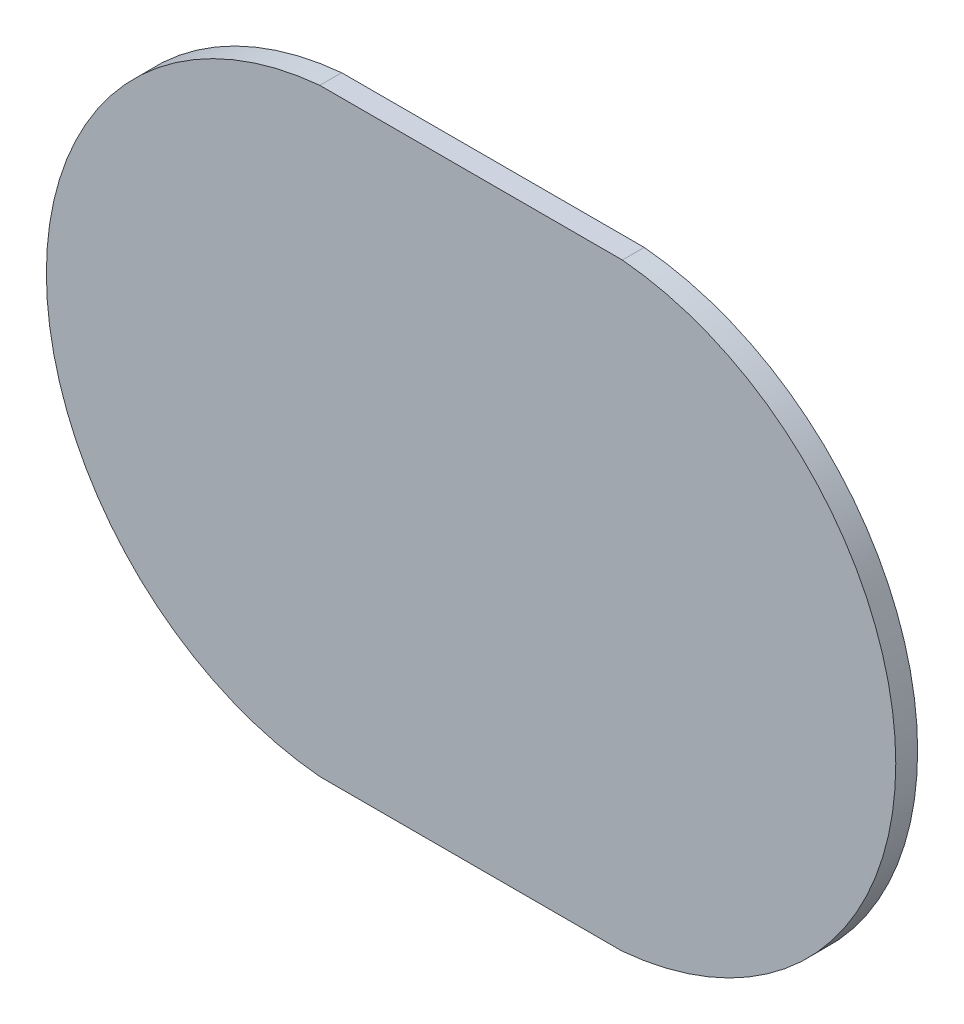
ISO-10303-21;
HEADER;
FILE_DESCRIPTION(('STEP AP214'),'2;1');
FILE_NAME('part.step','',(''),(''),'','','');
FILE_SCHEMA(('AUTOMOTIVE_DESIGN { 1 0 10303 214 1 1 1 1 }'));
ENDSEC;
DATA;
#1=APPLICATION_CONTEXT('core data for automotive mechanical design processes');
#2=APPLICATION_PROTOCOL_DEFINITION('international standard','automotive_design',2000,#1);
#3=PRODUCT_CONTEXT('',#1,'mechanical');
#4=PRODUCT('Part','Part','',(#3));
#5=PRODUCT_RELATED_PRODUCT_CATEGORY('part','',(#4));
#6=PRODUCT_DEFINITION_FORMATION('','',#4);
#7=PRODUCT_DEFINITION_CONTEXT('part definition',#1,'design');
#8=PRODUCT_DEFINITION('design','',#6,#7);
#9=PRODUCT_DEFINITION_SHAPE('','',#8);
#10=(LENGTH_UNIT() NAMED_UNIT(*) SI_UNIT(.MILLI.,.METRE.));
#11=(NAMED_UNIT(*) PLANE_ANGLE_UNIT() SI_UNIT($,.RADIAN.));
#12=(NAMED_UNIT(*) SI_UNIT($,.STERADIAN.) SOLID_ANGLE_UNIT());
#13=UNCERTAINTY_MEASURE_WITH_UNIT(LENGTH_MEASURE(1.E-05),#10,'distance_accuracy_value','');
#14=(GEOMETRIC_REPRESENTATION_CONTEXT(3) GLOBAL_UNCERTAINTY_ASSIGNED_CONTEXT((#13)) GLOBAL_UNIT_ASSIGNED_CONTEXT((#10,
#11,#12)) REPRESENTATION_CONTEXT('',''));
#15=CARTESIAN_POINT('',(0.,0.,0.));
#16=DIRECTION('',(0.,0.,1.));
#17=DIRECTION('',(1.,0.,0.));
#18=AXIS2_PLACEMENT_3D('',#15,#16,#17);
#19=CARTESIAN_POINT('',(-12.3042138671329,-1.03740541843096,-11.6112275560423));
#20=DIRECTION('',(0.,0.,1.));
#21=DIRECTION('',(0.,-1.,0.));
#22=AXIS2_PLACEMENT_3D('',#19,#20,#21);
#23=PLANE('',#22);
#24=DIRECTION('',(1.,0.,0.));
#25=VECTOR('',#24,1.);
#26=CARTESIAN_POINT('',(5.59246010386308,-2.60730240683621,-11.6112275560423));
#27=LINE('',#26,#25);
#28=CARTESIAN_POINT('',(5.5924601038631,-2.60730240683621,-11.6112275560423));
#29=VERTEX_POINT('',#28);
#30=CARTESIAN_POINT('',(6.31244295602997,-2.60730240683621,-11.6112275560423));
#31=VERTEX_POINT('',#30);
#32=EDGE_CURVE('E65',#29,#31,#27,.T.);
#33=ORIENTED_EDGE('',*,*,#32,.F.);
#34=CARTESIAN_POINT('',(5.65701003893155,-3.31956655943621,-11.6112275560423));
#35=DIRECTION('',(0.,0.,1.));
#36=DIRECTION('',(0.,-1.,0.));
#37=AXIS2_PLACEMENT_3D('',#34,#35,#36);
#38=CIRCLE('',#37,0.715183135424999);
#39=CARTESIAN_POINT('',(5.59246010386301,-4.0318307120362,-11.6112275560423));
#40=VERTEX_POINT('',#39);
#41=EDGE_CURVE('E19',#40,#29,#38,.F.);
#42=ORIENTED_EDGE('',*,*,#41,.F.);
#43=DIRECTION('',(1.,0.,0.));
#44=VECTOR('',#43,1.);
#45=CARTESIAN_POINT('',(6.31244295603,-4.03183071203621,-11.6112275560423));
#46=LINE('',#45,#44);
#47=CARTESIAN_POINT('',(6.31244295602997,-4.03183071203621,-11.6112275560423));
#48=VERTEX_POINT('',#47);
#49=EDGE_CURVE('E52',#48,#40,#46,.F.);
#50=ORIENTED_EDGE('',*,*,#49,.F.);
#51=CARTESIAN_POINT('',(6.24789302096153,-3.31956655943621,-11.6112275560423));
#52=DIRECTION('',(0.,0.,1.));
#53=DIRECTION('',(0.,-1.,0.));
#54=AXIS2_PLACEMENT_3D('',#51,#52,#53);
#55=CIRCLE('',#54,0.715183135424999);
#56=EDGE_CURVE('E67',#31,#48,#55,.F.);
#57=ORIENTED_EDGE('',*,*,#56,.F.);
#58=EDGE_LOOP('',(#33,#42,#50,#57));
#59=FACE_BOUND('',#58,.T.);
#60=ADVANCED_FACE('F16',(#59),#23,.T.);
#61=CARTESIAN_POINT('',(5.59246010386308,-2.60730240683621,-11.6112275560423));
#62=DIRECTION('',(0.,1.,0.));
#63=DIRECTION('',(0.,0.,1.));
#64=AXIS2_PLACEMENT_3D('',#61,#62,#63);
#65=PLANE('',#64);
#66=ORIENTED_EDGE('',*,*,#32,.T.);
#67=DIRECTION('',(0.,0.,1.));
#68=VECTOR('',#67,1.);
#69=CARTESIAN_POINT('',(6.31244295603,-2.60730240683622,-11.6112275560423));
#70=LINE('',#69,#68);
#71=CARTESIAN_POINT('',(6.31244295602997,-2.60730240683621,-11.6632275560423));
#72=VERTEX_POINT('',#71);
#73=EDGE_CURVE('E81',#72,#31,#70,.T.);
#74=ORIENTED_EDGE('',*,*,#73,.F.);
#75=DIRECTION('',(1.,0.,0.));
#76=VECTOR('',#75,1.);
#77=CARTESIAN_POINT('',(-12.3042138671329,-2.60730240683621,-11.6632275560423));
#78=LINE('',#77,#76);
#79=CARTESIAN_POINT('',(5.5924601038631,-2.60730240683621,-11.6632275560423));
#80=VERTEX_POINT('',#79);
#81=EDGE_CURVE('E74',#72,#80,#78,.F.);
#82=ORIENTED_EDGE('',*,*,#81,.T.);
#83=DIRECTION('',(0.,0.,1.));
#84=VECTOR('',#83,1.);
#85=CARTESIAN_POINT('',(5.59246010386308,-2.60730240683622,-11.6112275560423));
#86=LINE('',#85,#84);
#87=EDGE_CURVE('E61',#29,#80,#86,.F.);
#88=ORIENTED_EDGE('',*,*,#87,.F.);
#89=EDGE_LOOP('',(#66,#74,#82,#88));
#90=FACE_BOUND('',#89,.T.);
#91=ADVANCED_FACE('F73',(#90),#65,.T.);
#92=CARTESIAN_POINT('',(5.65701003893155,-3.31956655943621,-11.6112275560423));
#93=DIRECTION('',(0.,0.,1.));
#94=DIRECTION('',(0.,-1.,0.));
#95=AXIS2_PLACEMENT_3D('',#92,#93,#94);
#96=CYLINDRICAL_SURFACE('',#95,0.715183135424999);
#97=CARTESIAN_POINT('',(5.65701003893155,-3.31956655943621,-11.6632275560423));
#98=DIRECTION('',(0.,0.,1.));
#99=DIRECTION('',(0.,-1.,0.));
#100=AXIS2_PLACEMENT_3D('',#97,#98,#99);
#101=CIRCLE('',#100,0.715183135424999);
#102=CARTESIAN_POINT('',(5.59246010386306,-4.0318307120362,-11.6632275560423));
#103=VERTEX_POINT('',#102);
#104=EDGE_CURVE('E80',#80,#103,#101,.T.);
#105=ORIENTED_EDGE('',*,*,#104,.T.);
#106=DIRECTION('',(0.,0.,1.));
#107=VECTOR('',#106,1.);
#108=CARTESIAN_POINT('',(5.59246010386306,-4.0318307120362,-11.6112275560423));
#109=LINE('',#108,#107);
#110=EDGE_CURVE('E63',#40,#103,#109,.F.);
#111=ORIENTED_EDGE('',*,*,#110,.F.);
#112=ORIENTED_EDGE('',*,*,#41,.T.);
#113=ORIENTED_EDGE('',*,*,#87,.T.);
#114=EDGE_LOOP('',(#105,#111,#112,#113));
#115=FACE_BOUND('',#114,.T.);
#116=ADVANCED_FACE('F59',(#115),#96,.T.);
#117=CARTESIAN_POINT('',(6.31244295603,-4.03183071203621,-11.6112275560423));
#118=DIRECTION('',(0.,-1.,0.));
#119=DIRECTION('',(1.,0.,0.));
#120=AXIS2_PLACEMENT_3D('',#117,#118,#119);
#121=PLANE('',#120);
#122=ORIENTED_EDGE('',*,*,#49,.T.);
#123=ORIENTED_EDGE('',*,*,#110,.T.);
#124=DIRECTION('',(1.,0.,0.));
#125=VECTOR('',#124,1.);
#126=CARTESIAN_POINT('',(-12.3042138671329,-4.0318307120362,-11.6632275560423));
#127=LINE('',#126,#125);
#128=CARTESIAN_POINT('',(6.31244295603001,-4.0318307120362,-11.6632275560423));
#129=VERTEX_POINT('',#128);
#130=EDGE_CURVE('E25',#103,#129,#127,.T.);
#131=ORIENTED_EDGE('',*,*,#130,.T.);
#132=DIRECTION('',(0.,0.,1.));
#133=VECTOR('',#132,1.);
#134=CARTESIAN_POINT('',(6.31244295603,-4.03183071203621,-11.6112275560423));
#135=LINE('',#134,#133);
#136=EDGE_CURVE('E33',#48,#129,#135,.F.);
#137=ORIENTED_EDGE('',*,*,#136,.F.);
#138=EDGE_LOOP('',(#122,#123,#131,#137));
#139=FACE_BOUND('',#138,.T.);
#140=ADVANCED_FACE('F87',(#139),#121,.T.);
#141=CARTESIAN_POINT('',(6.24789302096153,-3.31956655943621,-11.6112275560423));
#142=DIRECTION('',(0.,0.,1.));
#143=DIRECTION('',(0.,-1.,0.));
#144=AXIS2_PLACEMENT_3D('',#141,#142,#143);
#145=CYLINDRICAL_SURFACE('',#144,0.715183135424999);
#146=ORIENTED_EDGE('',*,*,#56,.T.);
#147=ORIENTED_EDGE('',*,*,#136,.T.);
#148=CARTESIAN_POINT('',(6.24789302096153,-3.31956655943621,-11.6632275560423));
#149=DIRECTION('',(0.,0.,1.));
#150=DIRECTION('',(0.,-1.,0.));
#151=AXIS2_PLACEMENT_3D('',#148,#149,#150);
#152=CIRCLE('',#151,0.715183135424999);
#153=EDGE_CURVE('E11',#129,#72,#152,.T.);
#154=ORIENTED_EDGE('',*,*,#153,.T.);
#155=ORIENTED_EDGE('',*,*,#73,.T.);
#156=EDGE_LOOP('',(#146,#147,#154,#155));
#157=FACE_BOUND('',#156,.T.);
#158=ADVANCED_FACE('F90',(#157),#145,.T.);
#159=CARTESIAN_POINT('',(-12.3042138671329,-1.03740541843096,-11.6632275560423));
#160=DIRECTION('',(0.,0.,1.));
#161=DIRECTION('',(0.,-1.,0.));
#162=AXIS2_PLACEMENT_3D('',#159,#160,#161);
#163=PLANE('',#162);
#164=ORIENTED_EDGE('',*,*,#130,.F.);
#165=ORIENTED_EDGE('',*,*,#104,.F.);
#166=ORIENTED_EDGE('',*,*,#81,.F.);
#167=ORIENTED_EDGE('',*,*,#153,.F.);
#168=EDGE_LOOP('',(#164,#165,#166,#167));
#169=FACE_BOUND('',#168,.T.);
#170=ADVANCED_FACE('F89',(#169),#163,.F.);
#171=CLOSED_SHELL('',(#60,#91,#116,#140,#158,#170));
#172=MANIFOLD_SOLID_BREP('B1',#171);
#173=ADVANCED_BREP_SHAPE_REPRESENTATION('',(#18,#172),#14);
#174=SHAPE_DEFINITION_REPRESENTATION(#9,#173);
ENDSEC;
END-ISO-10303-21;
